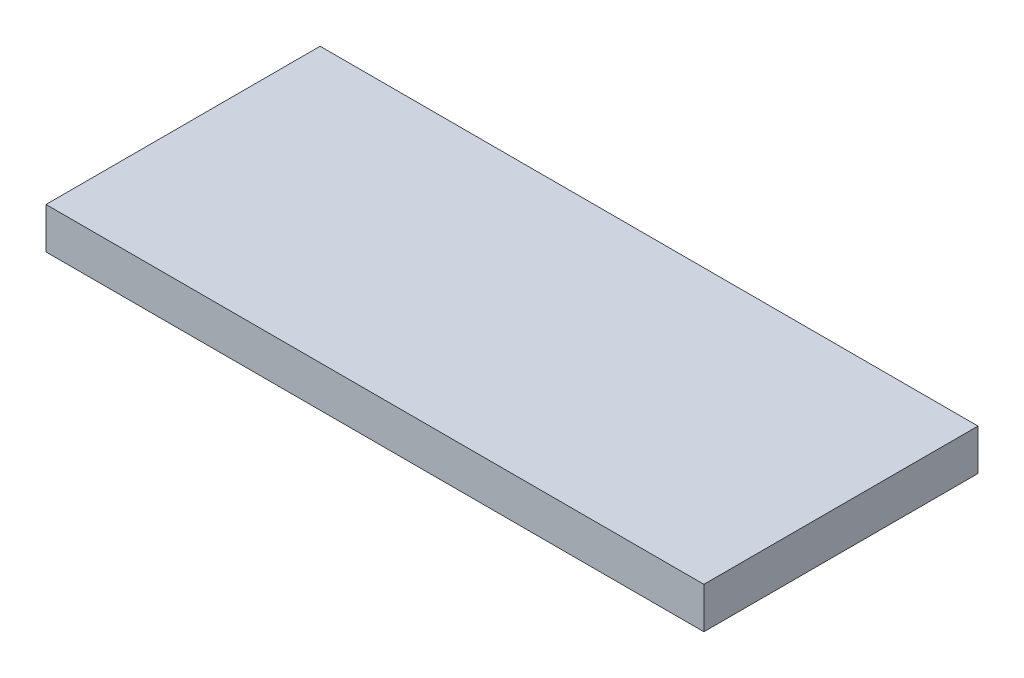
ISO-10303-21;
HEADER;
FILE_DESCRIPTION(('STEP AP214'),'2;1');
FILE_NAME('part.step','',(''),(''),'','','');
FILE_SCHEMA(('AUTOMOTIVE_DESIGN { 1 0 10303 214 1 1 1 1 }'));
ENDSEC;
DATA;
#1=APPLICATION_CONTEXT('core data for automotive mechanical design processes');
#2=APPLICATION_PROTOCOL_DEFINITION('international standard','automotive_design',2000,#1);
#3=PRODUCT_CONTEXT('',#1,'mechanical');
#4=PRODUCT('Part','Part','',(#3));
#5=PRODUCT_RELATED_PRODUCT_CATEGORY('part','',(#4));
#6=PRODUCT_DEFINITION_FORMATION('','',#4);
#7=PRODUCT_DEFINITION_CONTEXT('part definition',#1,'design');
#8=PRODUCT_DEFINITION('design','',#6,#7);
#9=PRODUCT_DEFINITION_SHAPE('','',#8);
#10=(LENGTH_UNIT() NAMED_UNIT(*) SI_UNIT(.MILLI.,.METRE.));
#11=(NAMED_UNIT(*) PLANE_ANGLE_UNIT() SI_UNIT($,.RADIAN.));
#12=(NAMED_UNIT(*) SI_UNIT($,.STERADIAN.) SOLID_ANGLE_UNIT());
#13=UNCERTAINTY_MEASURE_WITH_UNIT(LENGTH_MEASURE(1.E-05),#10,'distance_accuracy_value','');
#14=(GEOMETRIC_REPRESENTATION_CONTEXT(3) GLOBAL_UNCERTAINTY_ASSIGNED_CONTEXT((#13)) GLOBAL_UNIT_ASSIGNED_CONTEXT((#10,
#11,#12)) REPRESENTATION_CONTEXT('',''));
#15=CARTESIAN_POINT('',(0.,0.,0.));
#16=DIRECTION('',(0.,0.,1.));
#17=DIRECTION('',(1.,0.,0.));
#18=AXIS2_PLACEMENT_3D('',#15,#16,#17);
#19=CARTESIAN_POINT('',(-24.,3.,10.));
#20=DIRECTION('',(1.,0.,0.));
#21=DIRECTION('',(0.,0.,-1.));
#22=AXIS2_PLACEMENT_3D('',#19,#20,#21);
#23=PLANE('',#22);
#24=DIRECTION('',(0.,0.,1.));
#25=VECTOR('',#24,1.);
#26=CARTESIAN_POINT('',(-24.,0.,10.));
#27=LINE('',#26,#25);
#28=CARTESIAN_POINT('',(-24.,0.,-9.99999999999999));
#29=VERTEX_POINT('',#28);
#30=CARTESIAN_POINT('',(-24.,0.,10.));
#31=VERTEX_POINT('',#30);
#32=EDGE_CURVE('E96',#29,#31,#27,.T.);
#33=ORIENTED_EDGE('',*,*,#32,.T.);
#34=DIRECTION('',(0.,-1.,0.));
#35=VECTOR('',#34,1.);
#36=CARTESIAN_POINT('',(-24.,3.,10.));
#37=LINE('',#36,#35);
#38=CARTESIAN_POINT('',(-24.,3.,10.));
#39=VERTEX_POINT('',#38);
#40=EDGE_CURVE('E11',#39,#31,#37,.T.);
#41=ORIENTED_EDGE('',*,*,#40,.F.);
#42=DIRECTION('',(0.,0.,1.));
#43=VECTOR('',#42,1.);
#44=CARTESIAN_POINT('',(-24.,3.,10.));
#45=LINE('',#44,#43);
#46=CARTESIAN_POINT('',(-24.,3.,-9.99999999999999));
#47=VERTEX_POINT('',#46);
#48=EDGE_CURVE('E84',#47,#39,#45,.T.);
#49=ORIENTED_EDGE('',*,*,#48,.F.);
#50=DIRECTION('',(0.,-1.,0.));
#51=VECTOR('',#50,1.);
#52=CARTESIAN_POINT('',(-24.,3.,-9.99999999999999));
#53=LINE('',#52,#51);
#54=EDGE_CURVE('E92',#47,#29,#53,.T.);
#55=ORIENTED_EDGE('',*,*,#54,.T.);
#56=EDGE_LOOP('',(#33,#41,#49,#55));
#57=FACE_BOUND('',#56,.T.);
#58=ADVANCED_FACE('F33',(#57),#23,.F.);
#59=CARTESIAN_POINT('',(24.,3.,10.));
#60=DIRECTION('',(0.,0.,-1.));
#61=DIRECTION('',(-1.,0.,0.));
#62=AXIS2_PLACEMENT_3D('',#59,#60,#61);
#63=PLANE('',#62);
#64=DIRECTION('',(1.,0.,0.));
#65=VECTOR('',#64,1.);
#66=CARTESIAN_POINT('',(24.,0.,10.));
#67=LINE('',#66,#65);
#68=CARTESIAN_POINT('',(24.,0.,10.));
#69=VERTEX_POINT('',#68);
#70=EDGE_CURVE('E88',#31,#69,#67,.T.);
#71=ORIENTED_EDGE('',*,*,#70,.T.);
#72=DIRECTION('',(0.,-1.,0.));
#73=VECTOR('',#72,1.);
#74=CARTESIAN_POINT('',(24.,3.,10.));
#75=LINE('',#74,#73);
#76=CARTESIAN_POINT('',(24.,3.,10.));
#77=VERTEX_POINT('',#76);
#78=EDGE_CURVE('E41',#77,#69,#75,.T.);
#79=ORIENTED_EDGE('',*,*,#78,.F.);
#80=DIRECTION('',(1.,0.,0.));
#81=VECTOR('',#80,1.);
#82=CARTESIAN_POINT('',(24.,3.,10.));
#83=LINE('',#82,#81);
#84=EDGE_CURVE('E79',#39,#77,#83,.T.);
#85=ORIENTED_EDGE('',*,*,#84,.F.);
#86=ORIENTED_EDGE('',*,*,#40,.T.);
#87=EDGE_LOOP('',(#71,#79,#85,#86));
#88=FACE_BOUND('',#87,.T.);
#89=ADVANCED_FACE('F87',(#88),#63,.F.);
#90=CARTESIAN_POINT('',(24.,3.,10.));
#91=DIRECTION('',(-1.,0.,0.));
#92=DIRECTION('',(0.,0.,1.));
#93=AXIS2_PLACEMENT_3D('',#90,#91,#92);
#94=PLANE('',#93);
#95=DIRECTION('',(0.,0.,-1.));
#96=VECTOR('',#95,1.);
#97=CARTESIAN_POINT('',(24.,0.,10.));
#98=LINE('',#97,#96);
#99=CARTESIAN_POINT('',(24.,0.,-10.));
#100=VERTEX_POINT('',#99);
#101=EDGE_CURVE('E66',#69,#100,#98,.T.);
#102=ORIENTED_EDGE('',*,*,#101,.T.);
#103=DIRECTION('',(0.,-1.,0.));
#104=VECTOR('',#103,1.);
#105=CARTESIAN_POINT('',(24.,3.,-10.));
#106=LINE('',#105,#104);
#107=CARTESIAN_POINT('',(24.,3.,-10.));
#108=VERTEX_POINT('',#107);
#109=EDGE_CURVE('E89',#108,#100,#106,.T.);
#110=ORIENTED_EDGE('',*,*,#109,.F.);
#111=DIRECTION('',(0.,0.,-1.));
#112=VECTOR('',#111,1.);
#113=CARTESIAN_POINT('',(24.,3.,10.));
#114=LINE('',#113,#112);
#115=EDGE_CURVE('E82',#77,#108,#114,.T.);
#116=ORIENTED_EDGE('',*,*,#115,.F.);
#117=ORIENTED_EDGE('',*,*,#78,.T.);
#118=EDGE_LOOP('',(#102,#110,#116,#117));
#119=FACE_BOUND('',#118,.T.);
#120=ADVANCED_FACE('F90',(#119),#94,.F.);
#121=CARTESIAN_POINT('',(24.,3.,-10.));
#122=DIRECTION('',(0.,0.,1.));
#123=DIRECTION('',(1.,0.,0.));
#124=AXIS2_PLACEMENT_3D('',#121,#122,#123);
#125=PLANE('',#124);
#126=DIRECTION('',(-1.,0.,0.));
#127=VECTOR('',#126,1.);
#128=CARTESIAN_POINT('',(24.,0.,-10.));
#129=LINE('',#128,#127);
#130=EDGE_CURVE('E72',#100,#29,#129,.T.);
#131=ORIENTED_EDGE('',*,*,#130,.T.);
#132=ORIENTED_EDGE('',*,*,#54,.F.);
#133=DIRECTION('',(-1.,0.,0.));
#134=VECTOR('',#133,1.);
#135=CARTESIAN_POINT('',(24.,3.,-10.));
#136=LINE('',#135,#134);
#137=EDGE_CURVE('E49',#108,#47,#136,.T.);
#138=ORIENTED_EDGE('',*,*,#137,.F.);
#139=ORIENTED_EDGE('',*,*,#109,.T.);
#140=EDGE_LOOP('',(#131,#132,#138,#139));
#141=FACE_BOUND('',#140,.T.);
#142=ADVANCED_FACE('F103',(#141),#125,.F.);
#143=CARTESIAN_POINT('',(0.,3.,0.));
#144=DIRECTION('',(0.,1.,0.));
#145=DIRECTION('',(0.,0.,1.));
#146=AXIS2_PLACEMENT_3D('',#143,#144,#145);
#147=PLANE('',#146);
#148=ORIENTED_EDGE('',*,*,#48,.T.);
#149=ORIENTED_EDGE('',*,*,#84,.T.);
#150=ORIENTED_EDGE('',*,*,#115,.T.);
#151=ORIENTED_EDGE('',*,*,#137,.T.);
#152=EDGE_LOOP('',(#148,#149,#150,#151));
#153=FACE_BOUND('',#152,.T.);
#154=ADVANCED_FACE('F80',(#153),#147,.T.);
#155=CARTESIAN_POINT('',(0.,0.,0.));
#156=DIRECTION('',(0.,1.,0.));
#157=DIRECTION('',(0.,0.,1.));
#158=AXIS2_PLACEMENT_3D('',#155,#156,#157);
#159=PLANE('',#158);
#160=ORIENTED_EDGE('',*,*,#32,.F.);
#161=ORIENTED_EDGE('',*,*,#130,.F.);
#162=ORIENTED_EDGE('',*,*,#101,.F.);
#163=ORIENTED_EDGE('',*,*,#70,.F.);
#164=EDGE_LOOP('',(#160,#161,#162,#163));
#165=FACE_BOUND('',#164,.T.);
#166=ADVANCED_FACE('F106',(#165),#159,.F.);
#167=CLOSED_SHELL('',(#58,#89,#120,#142,#154,#166));
#168=MANIFOLD_SOLID_BREP('B2',#167);
#169=ADVANCED_BREP_SHAPE_REPRESENTATION('',(#18,#168),#14);
#170=SHAPE_DEFINITION_REPRESENTATION(#9,#169);
ENDSEC;
END-ISO-10303-21;
